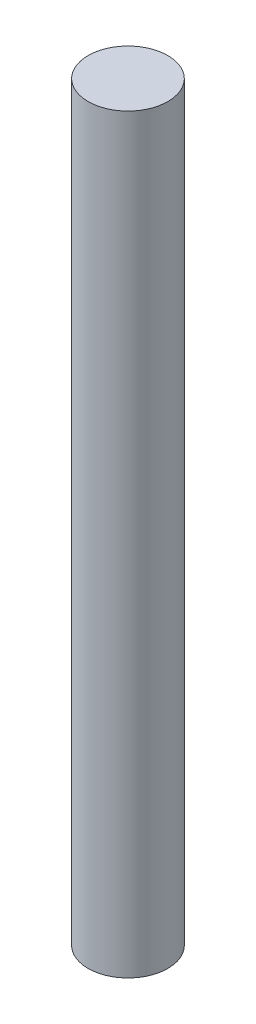
ISO-10303-21;
HEADER;
FILE_DESCRIPTION(('STEP AP214'),'2;1');
FILE_NAME('part.step','',(''),(''),'','','');
FILE_SCHEMA(('AUTOMOTIVE_DESIGN { 1 0 10303 214 1 1 1 1 }'));
ENDSEC;
DATA;
#1=APPLICATION_CONTEXT('core data for automotive mechanical design processes');
#2=APPLICATION_PROTOCOL_DEFINITION('international standard','automotive_design',2000,#1);
#3=PRODUCT_CONTEXT('',#1,'mechanical');
#4=PRODUCT('Part','Part','',(#3));
#5=PRODUCT_RELATED_PRODUCT_CATEGORY('part','',(#4));
#6=PRODUCT_DEFINITION_FORMATION('','',#4);
#7=PRODUCT_DEFINITION_CONTEXT('part definition',#1,'design');
#8=PRODUCT_DEFINITION('design','',#6,#7);
#9=PRODUCT_DEFINITION_SHAPE('','',#8);
#10=(LENGTH_UNIT() NAMED_UNIT(*) SI_UNIT(.MILLI.,.METRE.));
#11=(NAMED_UNIT(*) PLANE_ANGLE_UNIT() SI_UNIT($,.RADIAN.));
#12=(NAMED_UNIT(*) SI_UNIT($,.STERADIAN.) SOLID_ANGLE_UNIT());
#13=UNCERTAINTY_MEASURE_WITH_UNIT(LENGTH_MEASURE(1.E-05),#10,'distance_accuracy_value','');
#14=(GEOMETRIC_REPRESENTATION_CONTEXT(3) GLOBAL_UNCERTAINTY_ASSIGNED_CONTEXT((#13)) GLOBAL_UNIT_ASSIGNED_CONTEXT((#10,
#11,#12)) REPRESENTATION_CONTEXT('',''));
#15=CARTESIAN_POINT('',(0.,0.,0.));
#16=DIRECTION('',(0.,0.,1.));
#17=DIRECTION('',(1.,0.,0.));
#18=AXIS2_PLACEMENT_3D('',#15,#16,#17);
#19=CARTESIAN_POINT('',(0.,14.125,0.));
#20=DIRECTION('',(0.,-1.,0.));
#21=DIRECTION('',(0.,0.,-1.));
#22=AXIS2_PLACEMENT_3D('',#19,#20,#21);
#23=CYLINDRICAL_SURFACE('',#22,0.75);
#24=CARTESIAN_POINT('',(0.,14.125,0.));
#25=DIRECTION('',(0.,1.,0.));
#26=DIRECTION('',(0.,0.,1.));
#27=AXIS2_PLACEMENT_3D('',#24,#25,#26);
#28=CIRCLE('',#27,0.75);
#29=CARTESIAN_POINT('',(0.,14.125,0.75));
#30=VERTEX_POINT('',#29);
#31=EDGE_CURVE('E10',#30,#30,#28,.T.);
#32=ORIENTED_EDGE('',*,*,#31,.F.);
#33=EDGE_LOOP('',(#32));
#34=FACE_BOUND('',#33,.T.);
#35=CARTESIAN_POINT('',(0.,0.,0.));
#36=DIRECTION('',(0.,1.,0.));
#37=DIRECTION('',(0.,0.,1.));
#38=AXIS2_PLACEMENT_3D('',#35,#36,#37);
#39=CIRCLE('',#38,0.75);
#40=CARTESIAN_POINT('',(0.,0.,0.75));
#41=VERTEX_POINT('',#40);
#42=EDGE_CURVE('E38',#41,#41,#39,.T.);
#43=ORIENTED_EDGE('',*,*,#42,.T.);
#44=EDGE_LOOP('',(#43));
#45=FACE_BOUND('',#44,.T.);
#46=ADVANCED_FACE('F35',(#34,#45),#23,.T.);
#47=CARTESIAN_POINT('',(0.,14.125,0.));
#48=DIRECTION('',(0.,1.,0.));
#49=DIRECTION('',(0.,0.,1.));
#50=AXIS2_PLACEMENT_3D('',#47,#48,#49);
#51=PLANE('',#50);
#52=ORIENTED_EDGE('',*,*,#31,.T.);
#53=EDGE_LOOP('',(#52));
#54=FACE_BOUND('',#53,.T.);
#55=ADVANCED_FACE('F50',(#54),#51,.T.);
#56=CARTESIAN_POINT('',(0.,0.,0.));
#57=DIRECTION('',(0.,1.,0.));
#58=DIRECTION('',(0.,0.,1.));
#59=AXIS2_PLACEMENT_3D('',#56,#57,#58);
#60=PLANE('',#59);
#61=ORIENTED_EDGE('',*,*,#42,.F.);
#62=EDGE_LOOP('',(#61));
#63=FACE_BOUND('',#62,.T.);
#64=ADVANCED_FACE('F48',(#63),#60,.F.);
#65=CLOSED_SHELL('',(#46,#55,#64));
#66=MANIFOLD_SOLID_BREP('B2',#65);
#67=ADVANCED_BREP_SHAPE_REPRESENTATION('',(#18,#66),#14);
#68=SHAPE_DEFINITION_REPRESENTATION(#9,#67);
ENDSEC;
END-ISO-10303-21;
